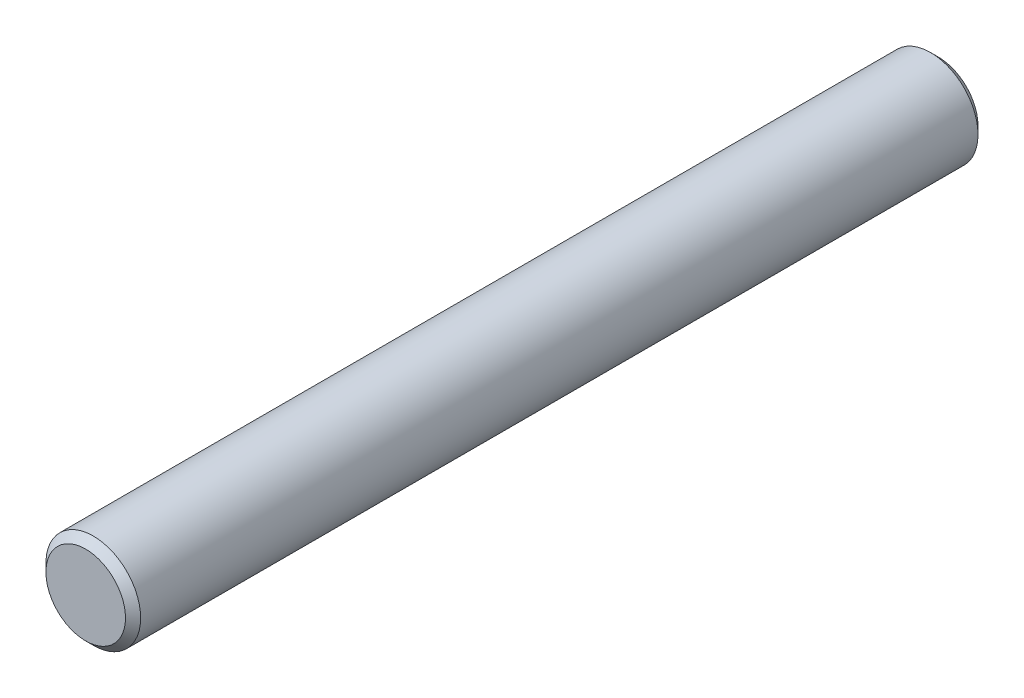
ISO-10303-21;
HEADER;
FILE_DESCRIPTION(('STEP AP214'),'2;1');
FILE_NAME('part.step','',(''),(''),'','','');
FILE_SCHEMA(('AUTOMOTIVE_DESIGN { 1 0 10303 214 1 1 1 1 }'));
ENDSEC;
DATA;
#1=APPLICATION_CONTEXT('core data for automotive mechanical design processes');
#2=APPLICATION_PROTOCOL_DEFINITION('international standard','automotive_design',2000,#1);
#3=PRODUCT_CONTEXT('',#1,'mechanical');
#4=PRODUCT('Part','Part','',(#3));
#5=PRODUCT_RELATED_PRODUCT_CATEGORY('part','',(#4));
#6=PRODUCT_DEFINITION_FORMATION('','',#4);
#7=PRODUCT_DEFINITION_CONTEXT('part definition',#1,'design');
#8=PRODUCT_DEFINITION('design','',#6,#7);
#9=PRODUCT_DEFINITION_SHAPE('','',#8);
#10=(LENGTH_UNIT() NAMED_UNIT(*) SI_UNIT(.MILLI.,.METRE.));
#11=(NAMED_UNIT(*) PLANE_ANGLE_UNIT() SI_UNIT($,.RADIAN.));
#12=(NAMED_UNIT(*) SI_UNIT($,.STERADIAN.) SOLID_ANGLE_UNIT());
#13=UNCERTAINTY_MEASURE_WITH_UNIT(LENGTH_MEASURE(1.E-05),#10,'distance_accuracy_value','');
#14=(GEOMETRIC_REPRESENTATION_CONTEXT(3) GLOBAL_UNCERTAINTY_ASSIGNED_CONTEXT((#13)) GLOBAL_UNIT_ASSIGNED_CONTEXT((#10,
#11,#12)) REPRESENTATION_CONTEXT('',''));
#15=CARTESIAN_POINT('',(0.,0.,0.));
#16=DIRECTION('',(0.,0.,1.));
#17=DIRECTION('',(1.,0.,0.));
#18=AXIS2_PLACEMENT_3D('',#15,#16,#17);
#19=CARTESIAN_POINT('',(0.,0.,45.));
#20=DIRECTION('',(0.,0.,-1.));
#21=DIRECTION('',(-1.,0.,0.));
#22=AXIS2_PLACEMENT_3D('',#19,#20,#21);
#23=CYLINDRICAL_SURFACE('',#22,2.5);
#24=CARTESIAN_POINT('',(0.,0.,0.400000000000046));
#25=DIRECTION('',(0.,0.,1.));
#26=DIRECTION('',(1.,0.,0.));
#27=AXIS2_PLACEMENT_3D('',#24,#25,#26);
#28=CIRCLE('',#27,2.5);
#29=CARTESIAN_POINT('',(2.5,0.,0.400000000000046));
#30=VERTEX_POINT('',#29);
#31=EDGE_CURVE('E53',#30,#30,#28,.T.);
#32=ORIENTED_EDGE('',*,*,#31,.T.);
#33=EDGE_LOOP('',(#32));
#34=FACE_BOUND('',#33,.T.);
#35=CARTESIAN_POINT('',(0.,0.,44.6));
#36=DIRECTION('',(0.,0.,1.));
#37=DIRECTION('',(1.,0.,0.));
#38=AXIS2_PLACEMENT_3D('',#35,#36,#37);
#39=CIRCLE('',#38,2.5);
#40=CARTESIAN_POINT('',(2.5,0.,44.6));
#41=VERTEX_POINT('',#40);
#42=EDGE_CURVE('E58',#41,#41,#39,.F.);
#43=ORIENTED_EDGE('',*,*,#42,.T.);
#44=EDGE_LOOP('',(#43));
#45=FACE_BOUND('',#44,.T.);
#46=ADVANCED_FACE('F39',(#34,#45),#23,.T.);
#47=CARTESIAN_POINT('',(0.,0.,45.));
#48=DIRECTION('',(0.,0.,1.));
#49=DIRECTION('',(1.,0.,0.));
#50=AXIS2_PLACEMENT_3D('',#47,#48,#49);
#51=PLANE('',#50);
#52=CARTESIAN_POINT('',(0.,0.,45.));
#53=DIRECTION('',(0.,0.,1.));
#54=DIRECTION('',(1.,0.,0.));
#55=AXIS2_PLACEMENT_3D('',#52,#53,#54);
#56=CIRCLE('',#55,2.10000000000005);
#57=CARTESIAN_POINT('',(2.10000000000005,0.,45.));
#58=VERTEX_POINT('',#57);
#59=EDGE_CURVE('E10',#58,#58,#56,.T.);
#60=ORIENTED_EDGE('',*,*,#59,.T.);
#61=EDGE_LOOP('',(#60));
#62=FACE_BOUND('',#61,.T.);
#63=ADVANCED_FACE('F75',(#62),#51,.T.);
#64=CARTESIAN_POINT('',(0.,0.,0.));
#65=DIRECTION('',(0.,0.,1.));
#66=DIRECTION('',(1.,0.,0.));
#67=AXIS2_PLACEMENT_3D('',#64,#65,#66);
#68=PLANE('',#67);
#69=CARTESIAN_POINT('',(0.,0.,0.));
#70=DIRECTION('',(0.,0.,1.));
#71=DIRECTION('',(1.,0.,0.));
#72=AXIS2_PLACEMENT_3D('',#69,#70,#71);
#73=CIRCLE('',#72,2.09999999999995);
#74=CARTESIAN_POINT('',(2.09999999999995,0.,0.));
#75=VERTEX_POINT('',#74);
#76=EDGE_CURVE('E48',#75,#75,#73,.F.);
#77=ORIENTED_EDGE('',*,*,#76,.T.);
#78=EDGE_LOOP('',(#77));
#79=FACE_BOUND('',#78,.T.);
#80=ADVANCED_FACE('F72',(#79),#68,.F.);
#81=CARTESIAN_POINT('',(0.,0.,0.400000000000046));
#82=DIRECTION('',(0.,0.,1.));
#83=DIRECTION('',(1.,0.,0.));
#84=AXIS2_PLACEMENT_3D('',#81,#82,#83);
#85=CONICAL_SURFACE('',#84,2.5,0.785398163397455);
#86=ORIENTED_EDGE('',*,*,#76,.F.);
#87=EDGE_LOOP('',(#86));
#88=FACE_BOUND('',#87,.T.);
#89=ORIENTED_EDGE('',*,*,#31,.F.);
#90=EDGE_LOOP('',(#89));
#91=FACE_BOUND('',#90,.T.);
#92=ADVANCED_FACE('F68',(#88,#91),#85,.T.);
#93=CARTESIAN_POINT('',(0.,0.,45.));
#94=DIRECTION('',(0.,0.,-1.));
#95=DIRECTION('',(-1.,0.,0.));
#96=AXIS2_PLACEMENT_3D('',#93,#94,#95);
#97=CONICAL_SURFACE('',#96,2.10000000000005,0.785398163397438);
#98=ORIENTED_EDGE('',*,*,#42,.F.);
#99=EDGE_LOOP('',(#98));
#100=FACE_BOUND('',#99,.T.);
#101=ORIENTED_EDGE('',*,*,#59,.F.);
#102=EDGE_LOOP('',(#101));
#103=FACE_BOUND('',#102,.T.);
#104=ADVANCED_FACE('F42',(#100,#103),#97,.T.);
#105=CLOSED_SHELL('',(#46,#63,#80,#92,#104));
#106=MANIFOLD_SOLID_BREP('B2',#105);
#107=ADVANCED_BREP_SHAPE_REPRESENTATION('',(#18,#106),#14);
#108=SHAPE_DEFINITION_REPRESENTATION(#9,#107);
ENDSEC;
END-ISO-10303-21;
